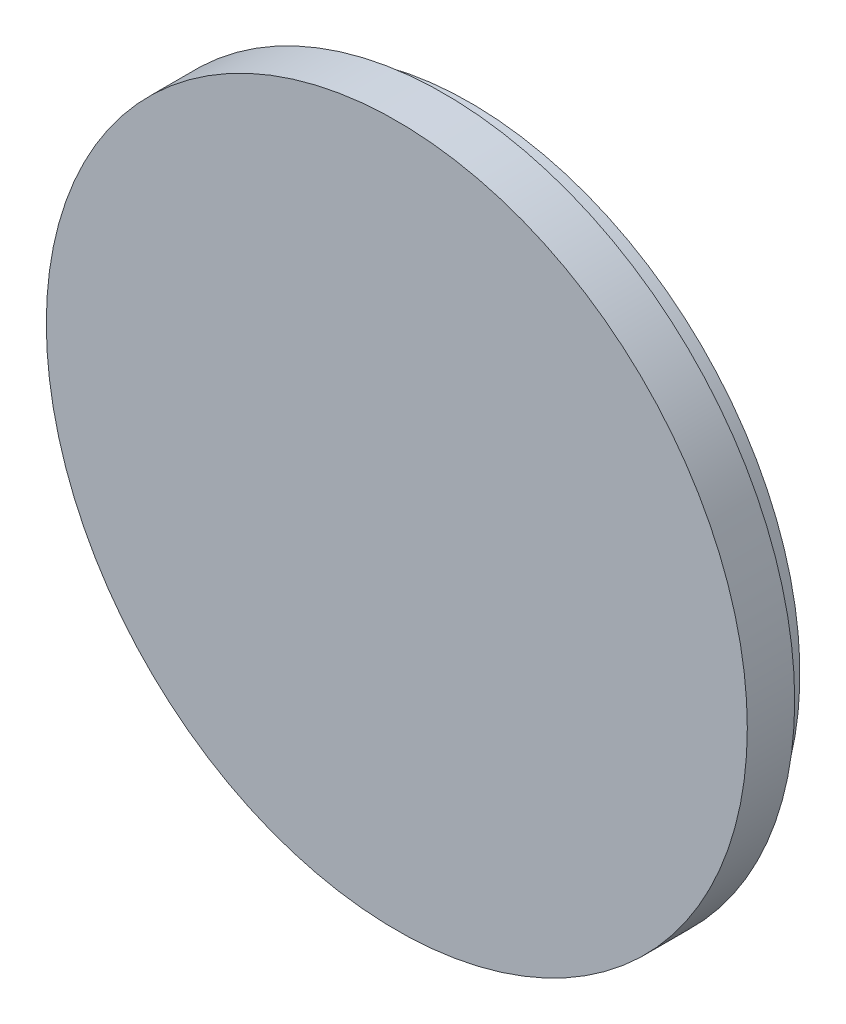
ISO-10303-21;
HEADER;
FILE_DESCRIPTION(('STEP AP214'),'2;1');
FILE_NAME('part.step','',(''),(''),'','','');
FILE_SCHEMA(('AUTOMOTIVE_DESIGN { 1 0 10303 214 1 1 1 1 }'));
ENDSEC;
DATA;
#1=APPLICATION_CONTEXT('core data for automotive mechanical design processes');
#2=APPLICATION_PROTOCOL_DEFINITION('international standard','automotive_design',2000,#1);
#3=PRODUCT_CONTEXT('',#1,'mechanical');
#4=PRODUCT('Part','Part','',(#3));
#5=PRODUCT_RELATED_PRODUCT_CATEGORY('part','',(#4));
#6=PRODUCT_DEFINITION_FORMATION('','',#4);
#7=PRODUCT_DEFINITION_CONTEXT('part definition',#1,'design');
#8=PRODUCT_DEFINITION('design','',#6,#7);
#9=PRODUCT_DEFINITION_SHAPE('','',#8);
#10=(LENGTH_UNIT() NAMED_UNIT(*) SI_UNIT(.MILLI.,.METRE.));
#11=(NAMED_UNIT(*) PLANE_ANGLE_UNIT() SI_UNIT($,.RADIAN.));
#12=(NAMED_UNIT(*) SI_UNIT($,.STERADIAN.) SOLID_ANGLE_UNIT());
#13=UNCERTAINTY_MEASURE_WITH_UNIT(LENGTH_MEASURE(1.E-05),#10,'distance_accuracy_value','');
#14=(GEOMETRIC_REPRESENTATION_CONTEXT(3) GLOBAL_UNCERTAINTY_ASSIGNED_CONTEXT((#13)) GLOBAL_UNIT_ASSIGNED_CONTEXT((#10,
#11,#12)) REPRESENTATION_CONTEXT('',''));
#15=CARTESIAN_POINT('',(0.,0.,0.));
#16=DIRECTION('',(0.,0.,1.));
#17=DIRECTION('',(1.,0.,0.));
#18=AXIS2_PLACEMENT_3D('',#15,#16,#17);
#19=CARTESIAN_POINT('',(0.,0.,3.65));
#20=DIRECTION('',(0.,0.,-1.));
#21=DIRECTION('',(-1.,0.,0.));
#22=AXIS2_PLACEMENT_3D('',#19,#20,#21);
#23=CYLINDRICAL_SURFACE('',#22,27.);
#24=CARTESIAN_POINT('',(0.,0.,3.65));
#25=DIRECTION('',(0.,0.,1.));
#26=DIRECTION('',(1.,0.,0.));
#27=AXIS2_PLACEMENT_3D('',#24,#25,#26);
#28=CIRCLE('',#27,27.);
#29=CARTESIAN_POINT('',(27.,0.,3.65));
#30=VERTEX_POINT('',#29);
#31=EDGE_CURVE('E44',#30,#30,#28,.T.);
#32=ORIENTED_EDGE('',*,*,#31,.F.);
#33=EDGE_LOOP('',(#32));
#34=FACE_BOUND('',#33,.T.);
#35=CARTESIAN_POINT('',(0.,0.,0.));
#36=DIRECTION('',(0.,0.,1.));
#37=DIRECTION('',(1.,0.,0.));
#38=AXIS2_PLACEMENT_3D('',#35,#36,#37);
#39=CIRCLE('',#38,27.);
#40=CARTESIAN_POINT('',(27.,0.,0.));
#41=VERTEX_POINT('',#40);
#42=EDGE_CURVE('E40',#41,#41,#39,.T.);
#43=ORIENTED_EDGE('',*,*,#42,.T.);
#44=EDGE_LOOP('',(#43));
#45=FACE_BOUND('',#44,.T.);
#46=ADVANCED_FACE('F37',(#34,#45),#23,.T.);
#47=CARTESIAN_POINT('',(0.,0.,3.65));
#48=DIRECTION('',(0.,0.,1.));
#49=DIRECTION('',(1.,0.,0.));
#50=AXIS2_PLACEMENT_3D('',#47,#48,#49);
#51=PLANE('',#50);
#52=ORIENTED_EDGE('',*,*,#31,.T.);
#53=EDGE_LOOP('',(#52));
#54=FACE_BOUND('',#53,.T.);
#55=ADVANCED_FACE('F61',(#54),#51,.T.);
#56=CARTESIAN_POINT('',(0.,0.,0.));
#57=DIRECTION('',(0.,0.,1.));
#58=DIRECTION('',(1.,0.,0.));
#59=AXIS2_PLACEMENT_3D('',#56,#57,#58);
#60=PLANE('',#59);
#61=CARTESIAN_POINT('',(0.,0.,0.));
#62=DIRECTION('',(0.,0.,-1.));
#63=DIRECTION('',(-1.,0.,0.));
#64=AXIS2_PLACEMENT_3D('',#61,#62,#63);
#65=CIRCLE('',#64,25.4);
#66=CARTESIAN_POINT('',(-25.4,0.,0.));
#67=VERTEX_POINT('',#66);
#68=EDGE_CURVE('E10',#67,#67,#65,.T.);
#69=ORIENTED_EDGE('',*,*,#68,.F.);
#70=EDGE_LOOP('',(#69));
#71=FACE_BOUND('',#70,.T.);
#72=ORIENTED_EDGE('',*,*,#42,.F.);
#73=EDGE_LOOP('',(#72));
#74=FACE_BOUND('',#73,.T.);
#75=ADVANCED_FACE('F58',(#71,#74),#60,.F.);
#76=CARTESIAN_POINT('',(0.,0.,-2.));
#77=DIRECTION('',(0.,0.,1.));
#78=DIRECTION('',(1.,0.,0.));
#79=AXIS2_PLACEMENT_3D('',#76,#77,#78);
#80=CYLINDRICAL_SURFACE('',#79,25.4);
#81=CARTESIAN_POINT('',(0.,0.,-2.));
#82=DIRECTION('',(0.,0.,-1.));
#83=DIRECTION('',(-1.,0.,0.));
#84=AXIS2_PLACEMENT_3D('',#81,#82,#83);
#85=CIRCLE('',#84,25.4);
#86=CARTESIAN_POINT('',(-25.4,0.,-2.));
#87=VERTEX_POINT('',#86);
#88=EDGE_CURVE('E50',#87,#87,#85,.T.);
#89=ORIENTED_EDGE('',*,*,#88,.F.);
#90=EDGE_LOOP('',(#89));
#91=FACE_BOUND('',#90,.T.);
#92=ORIENTED_EDGE('',*,*,#68,.T.);
#93=EDGE_LOOP('',(#92));
#94=FACE_BOUND('',#93,.T.);
#95=ADVANCED_FACE('F60',(#91,#94),#80,.T.);
#96=CARTESIAN_POINT('',(0.,0.,-2.));
#97=DIRECTION('',(0.,0.,-1.));
#98=DIRECTION('',(-1.,0.,0.));
#99=AXIS2_PLACEMENT_3D('',#96,#97,#98);
#100=PLANE('',#99);
#101=ORIENTED_EDGE('',*,*,#88,.T.);
#102=EDGE_LOOP('',(#101));
#103=FACE_BOUND('',#102,.T.);
#104=ADVANCED_FACE('F67',(#103),#100,.T.);
#105=CLOSED_SHELL('',(#46,#55,#75,#95,#104));
#106=MANIFOLD_SOLID_BREP('B2',#105);
#107=ADVANCED_BREP_SHAPE_REPRESENTATION('',(#18,#106),#14);
#108=SHAPE_DEFINITION_REPRESENTATION(#9,#107);
ENDSEC;
END-ISO-10303-21;
